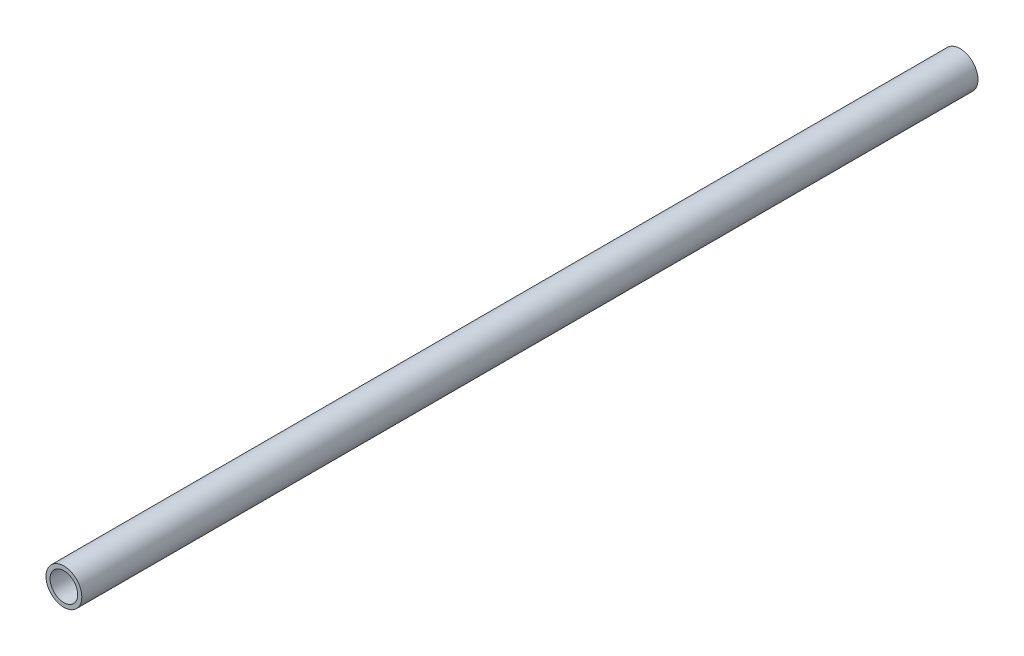
ISO-10303-21;
HEADER;
FILE_DESCRIPTION(('STEP AP214'),'2;1');
FILE_NAME('part.step','',(''),(''),'','','');
FILE_SCHEMA(('AUTOMOTIVE_DESIGN { 1 0 10303 214 1 1 1 1 }'));
ENDSEC;
DATA;
#1=APPLICATION_CONTEXT('core data for automotive mechanical design processes');
#2=APPLICATION_PROTOCOL_DEFINITION('international standard','automotive_design',2000,#1);
#3=PRODUCT_CONTEXT('',#1,'mechanical');
#4=PRODUCT('Part','Part','',(#3));
#5=PRODUCT_RELATED_PRODUCT_CATEGORY('part','',(#4));
#6=PRODUCT_DEFINITION_FORMATION('','',#4);
#7=PRODUCT_DEFINITION_CONTEXT('part definition',#1,'design');
#8=PRODUCT_DEFINITION('design','',#6,#7);
#9=PRODUCT_DEFINITION_SHAPE('','',#8);
#10=(LENGTH_UNIT() NAMED_UNIT(*) SI_UNIT(.MILLI.,.METRE.));
#11=(NAMED_UNIT(*) PLANE_ANGLE_UNIT() SI_UNIT($,.RADIAN.));
#12=(NAMED_UNIT(*) SI_UNIT($,.STERADIAN.) SOLID_ANGLE_UNIT());
#13=UNCERTAINTY_MEASURE_WITH_UNIT(LENGTH_MEASURE(1.E-05),#10,'distance_accuracy_value','');
#14=(GEOMETRIC_REPRESENTATION_CONTEXT(3) GLOBAL_UNCERTAINTY_ASSIGNED_CONTEXT((#13)) GLOBAL_UNIT_ASSIGNED_CONTEXT((#10,
#11,#12)) REPRESENTATION_CONTEXT('',''));
#15=CARTESIAN_POINT('',(0.,0.,0.));
#16=DIRECTION('',(0.,0.,1.));
#17=DIRECTION('',(1.,0.,0.));
#18=AXIS2_PLACEMENT_3D('',#15,#16,#17);
#19=CARTESIAN_POINT('',(-655.992889877271,-1.91945830914484,175.));
#20=DIRECTION('',(0.,0.,1.));
#21=DIRECTION('',(1.,0.,0.));
#22=AXIS2_PLACEMENT_3D('',#19,#20,#21);
#23=PLANE('',#22);
#24=CARTESIAN_POINT('',(-655.992889877271,-1.91945830914484,175.));
#25=DIRECTION('',(0.,0.,1.));
#26=DIRECTION('',(1.,0.,0.));
#27=AXIS2_PLACEMENT_3D('',#24,#25,#26);
#28=CIRCLE('',#27,3.49999999999996);
#29=CARTESIAN_POINT('',(-652.492889877271,-1.91945830914484,175.));
#30=VERTEX_POINT('',#29);
#31=EDGE_CURVE('E10',#30,#30,#28,.T.);
#32=ORIENTED_EDGE('',*,*,#31,.T.);
#33=EDGE_LOOP('',(#32));
#34=FACE_BOUND('',#33,.T.);
#35=CARTESIAN_POINT('',(-655.992889877271,-1.91945830914484,175.));
#36=DIRECTION('',(0.,0.,1.));
#37=DIRECTION('',(1.,0.,0.));
#38=AXIS2_PLACEMENT_3D('',#35,#36,#37);
#39=CIRCLE('',#38,2.70000000000001);
#40=CARTESIAN_POINT('',(-653.292889877271,-1.91945830914484,175.));
#41=VERTEX_POINT('',#40);
#42=EDGE_CURVE('E39',#41,#41,#39,.T.);
#43=ORIENTED_EDGE('',*,*,#42,.F.);
#44=EDGE_LOOP('',(#43));
#45=FACE_BOUND('',#44,.T.);
#46=ADVANCED_FACE('F28',(#34,#45),#23,.T.);
#47=CARTESIAN_POINT('',(-655.992889877271,-1.91945830914484,0.));
#48=DIRECTION('',(0.,0.,1.));
#49=DIRECTION('',(1.,0.,0.));
#50=AXIS2_PLACEMENT_3D('',#47,#48,#49);
#51=PLANE('',#50);
#52=CARTESIAN_POINT('',(-655.992889877271,-1.91945830914484,0.));
#53=DIRECTION('',(0.,0.,1.));
#54=DIRECTION('',(1.,0.,0.));
#55=AXIS2_PLACEMENT_3D('',#52,#53,#54);
#56=CIRCLE('',#55,3.49999999999996);
#57=CARTESIAN_POINT('',(-652.492889877271,-1.91945830914484,0.));
#58=VERTEX_POINT('',#57);
#59=EDGE_CURVE('E32',#58,#58,#56,.T.);
#60=ORIENTED_EDGE('',*,*,#59,.F.);
#61=EDGE_LOOP('',(#60));
#62=FACE_BOUND('',#61,.T.);
#63=CARTESIAN_POINT('',(-655.992889877271,-1.91945830914484,0.));
#64=DIRECTION('',(0.,0.,1.));
#65=DIRECTION('',(1.,0.,0.));
#66=AXIS2_PLACEMENT_3D('',#63,#64,#65);
#67=CIRCLE('',#66,2.70000000000001);
#68=CARTESIAN_POINT('',(-653.292889877271,-1.91945830914484,0.));
#69=VERTEX_POINT('',#68);
#70=EDGE_CURVE('E41',#69,#69,#67,.T.);
#71=ORIENTED_EDGE('',*,*,#70,.T.);
#72=EDGE_LOOP('',(#71));
#73=FACE_BOUND('',#72,.T.);
#74=ADVANCED_FACE('F51',(#62,#73),#51,.F.);
#75=CARTESIAN_POINT('',(-655.992889877271,-1.91945830914484,175.));
#76=DIRECTION('',(0.,0.,-1.));
#77=DIRECTION('',(-1.,0.,0.));
#78=AXIS2_PLACEMENT_3D('',#75,#76,#77);
#79=CYLINDRICAL_SURFACE('',#78,3.49999999999996);
#80=ORIENTED_EDGE('',*,*,#31,.F.);
#81=EDGE_LOOP('',(#80));
#82=FACE_BOUND('',#81,.T.);
#83=ORIENTED_EDGE('',*,*,#59,.T.);
#84=EDGE_LOOP('',(#83));
#85=FACE_BOUND('',#84,.T.);
#86=ADVANCED_FACE('F30',(#82,#85),#79,.T.);
#87=CARTESIAN_POINT('',(-655.992889877271,-1.91945830914484,175.));
#88=DIRECTION('',(0.,0.,-1.));
#89=DIRECTION('',(-1.,0.,0.));
#90=AXIS2_PLACEMENT_3D('',#87,#88,#89);
#91=CYLINDRICAL_SURFACE('',#90,2.70000000000001);
#92=ORIENTED_EDGE('',*,*,#42,.T.);
#93=EDGE_LOOP('',(#92));
#94=FACE_BOUND('',#93,.T.);
#95=ORIENTED_EDGE('',*,*,#70,.F.);
#96=EDGE_LOOP('',(#95));
#97=FACE_BOUND('',#96,.T.);
#98=ADVANCED_FACE('F47',(#94,#97),#91,.F.);
#99=CLOSED_SHELL('',(#46,#74,#86,#98));
#100=MANIFOLD_SOLID_BREP('B2',#99);
#101=ADVANCED_BREP_SHAPE_REPRESENTATION('',(#18,#100),#14);
#102=SHAPE_DEFINITION_REPRESENTATION(#9,#101);
ENDSEC;
END-ISO-10303-21;
